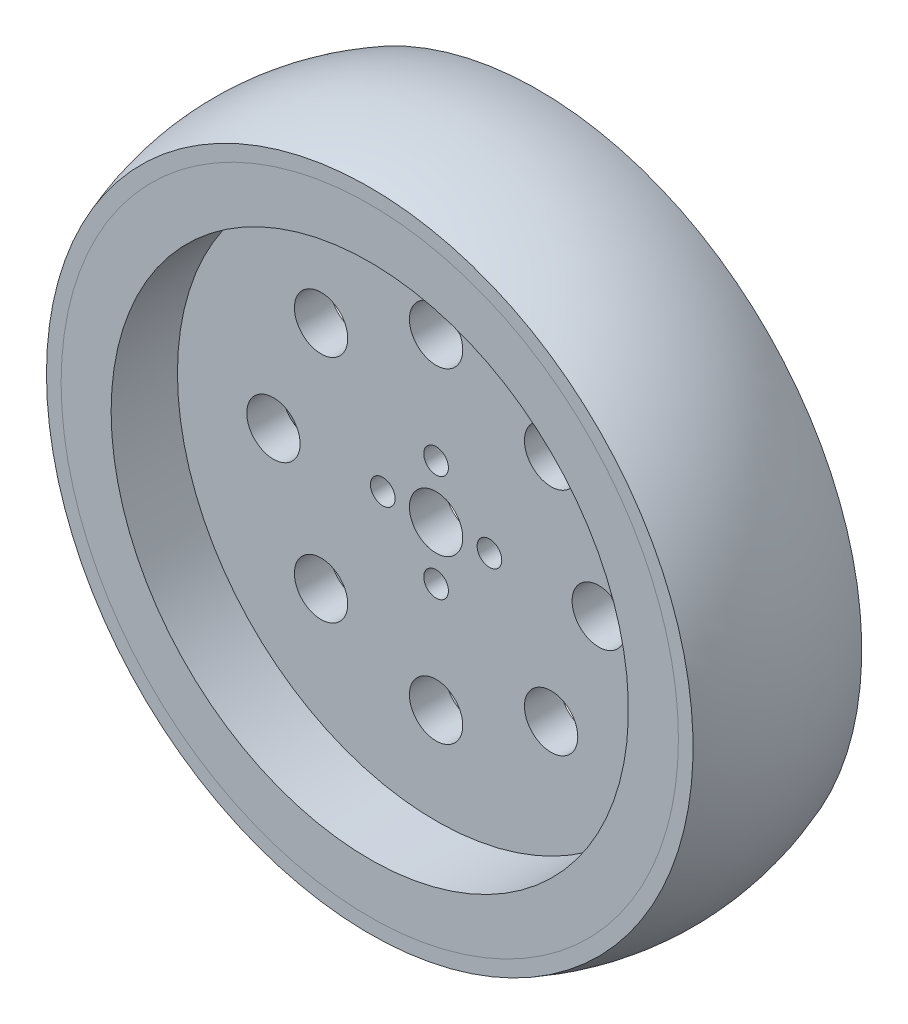
ISO-10303-21;
HEADER;
FILE_DESCRIPTION(('STEP AP214'),'2;1');
FILE_NAME('part.step','',(''),(''),'','','');
FILE_SCHEMA(('AUTOMOTIVE_DESIGN { 1 0 10303 214 1 1 1 1 }'));
ENDSEC;
DATA;
#1=APPLICATION_CONTEXT('core data for automotive mechanical design processes');
#2=APPLICATION_PROTOCOL_DEFINITION('international standard','automotive_design',2000,#1);
#3=PRODUCT_CONTEXT('',#1,'mechanical');
#4=PRODUCT('Part','Part','',(#3));
#5=PRODUCT_RELATED_PRODUCT_CATEGORY('part','',(#4));
#6=PRODUCT_DEFINITION_FORMATION('','',#4);
#7=PRODUCT_DEFINITION_CONTEXT('part definition',#1,'design');
#8=PRODUCT_DEFINITION('design','',#6,#7);
#9=PRODUCT_DEFINITION_SHAPE('','',#8);
#10=(LENGTH_UNIT() NAMED_UNIT(*) SI_UNIT(.MILLI.,.METRE.));
#11=(NAMED_UNIT(*) PLANE_ANGLE_UNIT() SI_UNIT($,.RADIAN.));
#12=(NAMED_UNIT(*) SI_UNIT($,.STERADIAN.) SOLID_ANGLE_UNIT());
#13=UNCERTAINTY_MEASURE_WITH_UNIT(LENGTH_MEASURE(1.E-05),#10,'distance_accuracy_value','');
#14=(GEOMETRIC_REPRESENTATION_CONTEXT(3) GLOBAL_UNCERTAINTY_ASSIGNED_CONTEXT((#13)) GLOBAL_UNIT_ASSIGNED_CONTEXT((#10,
#11,#12)) REPRESENTATION_CONTEXT('',''));
#15=CARTESIAN_POINT('',(0.,0.,0.));
#16=DIRECTION('',(0.,0.,1.));
#17=DIRECTION('',(1.,0.,0.));
#18=AXIS2_PLACEMENT_3D('',#15,#16,#17);
#19=CARTESIAN_POINT('',(38.8,0.,12.65));
#20=DIRECTION('',(0.,0.,-1.));
#21=DIRECTION('',(-1.,0.,0.));
#22=AXIS2_PLACEMENT_3D('',#19,#20,#21);
#23=PLANE('',#22);
#24=CARTESIAN_POINT('',(0.,0.,12.65));
#25=DIRECTION('',(0.,0.,-1.));
#26=DIRECTION('',(-1.,0.,0.));
#27=AXIS2_PLACEMENT_3D('',#24,#25,#26);
#28=CIRCLE('',#27,38.8);
#29=CARTESIAN_POINT('',(-38.8,0.,12.65));
#30=VERTEX_POINT('',#29);
#31=EDGE_CURVE('P0_E164',#30,#30,#28,.T.);
#32=ORIENTED_EDGE('',*,*,#31,.T.);
#33=EDGE_LOOP('',(#32));
#34=FACE_BOUND('',#33,.T.);
#35=CARTESIAN_POINT('',(0.,0.,12.65));
#36=DIRECTION('',(0.,0.,-1.));
#37=DIRECTION('',(-1.,0.,0.));
#38=AXIS2_PLACEMENT_3D('',#35,#36,#37);
#39=CIRCLE('',#38,46.3);
#40=CARTESIAN_POINT('',(-46.3,0.,12.65));
#41=VERTEX_POINT('',#40);
#42=EDGE_CURVE('P0_E10',#41,#41,#39,.T.);
#43=ORIENTED_EDGE('',*,*,#42,.F.);
#44=EDGE_LOOP('',(#43));
#45=FACE_BOUND('',#44,.T.);
#46=ADVANCED_FACE('P0_F14',(#34,#45),#23,.F.);
#47=CARTESIAN_POINT('',(0.,0.,-12.65));
#48=DIRECTION('',(0.,0.,-1.));
#49=DIRECTION('',(-1.,0.,0.));
#50=AXIS2_PLACEMENT_3D('',#47,#48,#49);
#51=CYLINDRICAL_SURFACE('',#50,46.3);
#52=CARTESIAN_POINT('',(0.,0.,10.65));
#53=DIRECTION('',(0.,0.,-1.));
#54=DIRECTION('',(-1.,0.,0.));
#55=AXIS2_PLACEMENT_3D('',#52,#53,#54);
#56=CIRCLE('',#55,46.3);
#57=CARTESIAN_POINT('',(-46.3,0.,10.65));
#58=VERTEX_POINT('',#57);
#59=EDGE_CURVE('P0_E21',#58,#58,#56,.T.);
#60=ORIENTED_EDGE('',*,*,#59,.F.);
#61=EDGE_LOOP('',(#60));
#62=FACE_BOUND('',#61,.T.);
#63=ORIENTED_EDGE('',*,*,#42,.T.);
#64=EDGE_LOOP('',(#63));
#65=FACE_BOUND('',#64,.T.);
#66=ADVANCED_FACE('P0_F236',(#62,#65),#51,.T.);
#67=CARTESIAN_POINT('',(46.3,0.,10.65));
#68=DIRECTION('',(0.,0.,1.));
#69=DIRECTION('',(1.,0.,0.));
#70=AXIS2_PLACEMENT_3D('',#67,#68,#69);
#71=PLANE('',#70);
#72=CARTESIAN_POINT('',(0.,0.,10.65));
#73=DIRECTION('',(0.,0.,-1.));
#74=DIRECTION('',(-1.,0.,0.));
#75=AXIS2_PLACEMENT_3D('',#72,#73,#74);
#76=CIRCLE('',#75,44.);
#77=CARTESIAN_POINT('',(-44.,0.,10.65));
#78=VERTEX_POINT('',#77);
#79=EDGE_CURVE('P0_E28',#78,#78,#76,.T.);
#80=ORIENTED_EDGE('',*,*,#79,.F.);
#81=EDGE_LOOP('',(#80));
#82=FACE_BOUND('',#81,.T.);
#83=ORIENTED_EDGE('',*,*,#59,.T.);
#84=EDGE_LOOP('',(#83));
#85=FACE_BOUND('',#84,.T.);
#86=ADVANCED_FACE('P0_F231',(#82,#85),#71,.F.);
#87=CARTESIAN_POINT('',(0.,0.,-12.65));
#88=DIRECTION('',(0.,0.,-1.));
#89=DIRECTION('',(-1.,0.,0.));
#90=AXIS2_PLACEMENT_3D('',#87,#88,#89);
#91=CYLINDRICAL_SURFACE('',#90,44.);
#92=CARTESIAN_POINT('',(0.,0.,-10.65));
#93=DIRECTION('',(0.,0.,-1.));
#94=DIRECTION('',(-1.,0.,0.));
#95=AXIS2_PLACEMENT_3D('',#92,#93,#94);
#96=CIRCLE('',#95,44.);
#97=CARTESIAN_POINT('',(-44.,0.,-10.65));
#98=VERTEX_POINT('',#97);
#99=EDGE_CURVE('P0_E34',#98,#98,#96,.T.);
#100=ORIENTED_EDGE('',*,*,#99,.F.);
#101=EDGE_LOOP('',(#100));
#102=FACE_BOUND('',#101,.T.);
#103=ORIENTED_EDGE('',*,*,#79,.T.);
#104=EDGE_LOOP('',(#103));
#105=FACE_BOUND('',#104,.T.);
#106=ADVANCED_FACE('P0_F225',(#102,#105),#91,.T.);
#107=CARTESIAN_POINT('',(44.,0.,-10.65));
#108=DIRECTION('',(0.,0.,-1.));
#109=DIRECTION('',(-1.,0.,0.));
#110=AXIS2_PLACEMENT_3D('',#107,#108,#109);
#111=PLANE('',#110);
#112=CARTESIAN_POINT('',(0.,0.,-10.65));
#113=DIRECTION('',(0.,0.,-1.));
#114=DIRECTION('',(-1.,0.,0.));
#115=AXIS2_PLACEMENT_3D('',#112,#113,#114);
#116=CIRCLE('',#115,46.3);
#117=CARTESIAN_POINT('',(-46.3,0.,-10.65));
#118=VERTEX_POINT('',#117);
#119=EDGE_CURVE('P0_E40',#118,#118,#116,.T.);
#120=ORIENTED_EDGE('',*,*,#119,.F.);
#121=EDGE_LOOP('',(#120));
#122=FACE_BOUND('',#121,.T.);
#123=ORIENTED_EDGE('',*,*,#99,.T.);
#124=EDGE_LOOP('',(#123));
#125=FACE_BOUND('',#124,.T.);
#126=ADVANCED_FACE('P0_F219',(#122,#125),#111,.F.);
#127=CARTESIAN_POINT('',(0.,0.,-12.65));
#128=DIRECTION('',(0.,0.,-1.));
#129=DIRECTION('',(-1.,0.,0.));
#130=AXIS2_PLACEMENT_3D('',#127,#128,#129);
#131=CYLINDRICAL_SURFACE('',#130,46.3);
#132=CARTESIAN_POINT('',(0.,0.,-12.65));
#133=DIRECTION('',(0.,0.,-1.));
#134=DIRECTION('',(-1.,0.,0.));
#135=AXIS2_PLACEMENT_3D('',#132,#133,#134);
#136=CIRCLE('',#135,46.3);
#137=CARTESIAN_POINT('',(-46.3,0.,-12.65));
#138=VERTEX_POINT('',#137);
#139=EDGE_CURVE('P0_E44',#138,#138,#136,.T.);
#140=ORIENTED_EDGE('',*,*,#139,.F.);
#141=EDGE_LOOP('',(#140));
#142=FACE_BOUND('',#141,.T.);
#143=ORIENTED_EDGE('',*,*,#119,.T.);
#144=EDGE_LOOP('',(#143));
#145=FACE_BOUND('',#144,.T.);
#146=ADVANCED_FACE('P0_F213',(#142,#145),#131,.T.);
#147=CARTESIAN_POINT('',(46.3,0.,-12.65));
#148=DIRECTION('',(0.,0.,1.));
#149=DIRECTION('',(1.,0.,0.));
#150=AXIS2_PLACEMENT_3D('',#147,#148,#149);
#151=PLANE('',#150);
#152=CARTESIAN_POINT('',(0.,0.,-12.65));
#153=DIRECTION('',(0.,0.,-1.));
#154=DIRECTION('',(-1.,0.,0.));
#155=AXIS2_PLACEMENT_3D('',#152,#153,#154);
#156=CIRCLE('',#155,38.8);
#157=CARTESIAN_POINT('',(-38.8,0.,-12.65));
#158=VERTEX_POINT('',#157);
#159=EDGE_CURVE('P0_E160',#158,#158,#156,.T.);
#160=ORIENTED_EDGE('',*,*,#159,.F.);
#161=EDGE_LOOP('',(#160));
#162=FACE_BOUND('',#161,.T.);
#163=ORIENTED_EDGE('',*,*,#139,.T.);
#164=EDGE_LOOP('',(#163));
#165=FACE_BOUND('',#164,.T.);
#166=ADVANCED_FACE('P0_F207',(#162,#165),#151,.F.);
#167=CARTESIAN_POINT('',(0.,0.,-12.65));
#168=DIRECTION('',(0.,0.,-1.));
#169=DIRECTION('',(-1.,0.,0.));
#170=AXIS2_PLACEMENT_3D('',#167,#168,#169);
#171=CYLINDRICAL_SURFACE('',#170,38.8);
#172=CARTESIAN_POINT('',(0.,0.,-2.69999999999999));
#173=DIRECTION('',(0.,0.,-1.));
#174=DIRECTION('',(-1.,0.,0.));
#175=AXIS2_PLACEMENT_3D('',#172,#173,#174);
#176=CIRCLE('',#175,38.8);
#177=CARTESIAN_POINT('',(-38.8,0.,-2.69999999999998));
#178=VERTEX_POINT('',#177);
#179=EDGE_CURVE('P0_E48',#178,#178,#176,.T.);
#180=ORIENTED_EDGE('',*,*,#179,.F.);
#181=EDGE_LOOP('',(#180));
#182=FACE_BOUND('',#181,.T.);
#183=ORIENTED_EDGE('',*,*,#159,.T.);
#184=EDGE_LOOP('',(#183));
#185=FACE_BOUND('',#184,.T.);
#186=ADVANCED_FACE('P0_F193',(#182,#185),#171,.F.);
#187=CARTESIAN_POINT('',(0.,0.,-12.65));
#188=DIRECTION('',(0.,0.,-1.));
#189=DIRECTION('',(-1.,0.,0.));
#190=AXIS2_PLACEMENT_3D('',#187,#188,#189);
#191=CYLINDRICAL_SURFACE('',#190,4.);
#192=CARTESIAN_POINT('',(0.,0.,2.7));
#193=DIRECTION('',(0.,0.,-1.));
#194=DIRECTION('',(-1.,0.,0.));
#195=AXIS2_PLACEMENT_3D('',#192,#193,#194);
#196=CIRCLE('',#195,4.);
#197=CARTESIAN_POINT('',(-4.,0.,2.7));
#198=VERTEX_POINT('',#197);
#199=EDGE_CURVE('P0_E104',#198,#198,#196,.T.);
#200=ORIENTED_EDGE('',*,*,#199,.F.);
#201=EDGE_LOOP('',(#200));
#202=FACE_BOUND('',#201,.T.);
#203=CARTESIAN_POINT('',(0.,0.,-2.69999999999999));
#204=DIRECTION('',(0.,0.,-1.));
#205=DIRECTION('',(-1.,0.,0.));
#206=AXIS2_PLACEMENT_3D('',#203,#204,#205);
#207=CIRCLE('',#206,4.);
#208=CARTESIAN_POINT('',(-4.,0.,-2.69999999999999));
#209=VERTEX_POINT('',#208);
#210=EDGE_CURVE('P0_E52',#209,#209,#207,.T.);
#211=ORIENTED_EDGE('',*,*,#210,.T.);
#212=EDGE_LOOP('',(#211));
#213=FACE_BOUND('',#212,.T.);
#214=ADVANCED_FACE('P0_F189',(#202,#213),#191,.F.);
#215=CARTESIAN_POINT('',(-17.2534054609517,17.2534054609518,-12.65));
#216=DIRECTION('',(0.,0.,1.));
#217=DIRECTION('',(1.,0.,0.));
#218=AXIS2_PLACEMENT_3D('',#215,#216,#217);
#219=CYLINDRICAL_SURFACE('',#218,4.);
#220=CARTESIAN_POINT('',(-17.2534054609517,17.2534054609518,2.70000000000001));
#221=DIRECTION('',(0.,0.,-1.));
#222=DIRECTION('',(-1.,0.,0.));
#223=AXIS2_PLACEMENT_3D('',#220,#221,#222);
#224=CIRCLE('',#223,4.);
#225=CARTESIAN_POINT('',(-21.2534054609517,17.2534054609518,2.70000000000001));
#226=VERTEX_POINT('',#225);
#227=EDGE_CURVE('P0_E108',#226,#226,#224,.T.);
#228=ORIENTED_EDGE('',*,*,#227,.F.);
#229=EDGE_LOOP('',(#228));
#230=FACE_BOUND('',#229,.T.);
#231=CARTESIAN_POINT('',(-17.2534054609517,17.2534054609518,-2.69999999999999));
#232=DIRECTION('',(0.,0.,1.));
#233=DIRECTION('',(1.,0.,0.));
#234=AXIS2_PLACEMENT_3D('',#231,#232,#233);
#235=CIRCLE('',#234,4.);
#236=CARTESIAN_POINT('',(-13.2534054609517,17.2534054609518,-2.69999999999999));
#237=VERTEX_POINT('',#236);
#238=EDGE_CURVE('P0_E56',#237,#237,#235,.T.);
#239=ORIENTED_EDGE('',*,*,#238,.F.);
#240=EDGE_LOOP('',(#239));
#241=FACE_BOUND('',#240,.T.);
#242=ADVANCED_FACE('P0_F192',(#230,#241),#219,.F.);
#243=CARTESIAN_POINT('',(-24.4,0.,-12.65));
#244=DIRECTION('',(0.,0.,1.));
#245=DIRECTION('',(1.,0.,0.));
#246=AXIS2_PLACEMENT_3D('',#243,#244,#245);
#247=CYLINDRICAL_SURFACE('',#246,4.);
#248=CARTESIAN_POINT('',(-24.4,0.,2.70000000000001));
#249=DIRECTION('',(0.,0.,-1.));
#250=DIRECTION('',(-1.,0.,0.));
#251=AXIS2_PLACEMENT_3D('',#248,#249,#250);
#252=CIRCLE('',#251,4.);
#253=CARTESIAN_POINT('',(-28.4,0.,2.70000000000001));
#254=VERTEX_POINT('',#253);
#255=EDGE_CURVE('P0_E112',#254,#254,#252,.T.);
#256=ORIENTED_EDGE('',*,*,#255,.F.);
#257=EDGE_LOOP('',(#256));
#258=FACE_BOUND('',#257,.T.);
#259=CARTESIAN_POINT('',(-24.4,0.,-2.69999999999998));
#260=DIRECTION('',(0.,0.,1.));
#261=DIRECTION('',(1.,0.,0.));
#262=AXIS2_PLACEMENT_3D('',#259,#260,#261);
#263=CIRCLE('',#262,4.);
#264=CARTESIAN_POINT('',(-20.4,0.,-2.69999999999999));
#265=VERTEX_POINT('',#264);
#266=EDGE_CURVE('P0_E60',#265,#265,#263,.T.);
#267=ORIENTED_EDGE('',*,*,#266,.F.);
#268=EDGE_LOOP('',(#267));
#269=FACE_BOUND('',#268,.T.);
#270=ADVANCED_FACE('P0_F319',(#258,#269),#247,.F.);
#271=CARTESIAN_POINT('',(-17.2534054609518,-17.2534054609517,-12.65));
#272=DIRECTION('',(0.,0.,1.));
#273=DIRECTION('',(1.,0.,0.));
#274=AXIS2_PLACEMENT_3D('',#271,#272,#273);
#275=CYLINDRICAL_SURFACE('',#274,4.);
#276=CARTESIAN_POINT('',(-17.2534054609518,-17.2534054609517,2.70000000000001));
#277=DIRECTION('',(0.,0.,-1.));
#278=DIRECTION('',(-1.,0.,0.));
#279=AXIS2_PLACEMENT_3D('',#276,#277,#278);
#280=CIRCLE('',#279,4.);
#281=CARTESIAN_POINT('',(-21.2534054609518,-17.2534054609517,2.70000000000001));
#282=VERTEX_POINT('',#281);
#283=EDGE_CURVE('P0_E116',#282,#282,#280,.T.);
#284=ORIENTED_EDGE('',*,*,#283,.F.);
#285=EDGE_LOOP('',(#284));
#286=FACE_BOUND('',#285,.T.);
#287=CARTESIAN_POINT('',(-17.2534054609518,-17.2534054609517,-2.69999999999999));
#288=DIRECTION('',(0.,0.,1.));
#289=DIRECTION('',(1.,0.,0.));
#290=AXIS2_PLACEMENT_3D('',#287,#288,#289);
#291=CIRCLE('',#290,4.);
#292=CARTESIAN_POINT('',(-13.2534054609518,-17.2534054609517,-2.69999999999999));
#293=VERTEX_POINT('',#292);
#294=EDGE_CURVE('P0_E64',#293,#293,#291,.T.);
#295=ORIENTED_EDGE('',*,*,#294,.F.);
#296=EDGE_LOOP('',(#295));
#297=FACE_BOUND('',#296,.T.);
#298=ADVANCED_FACE('P0_F331',(#286,#297),#275,.F.);
#299=CARTESIAN_POINT('',(0.,-24.4,-12.65));
#300=DIRECTION('',(0.,0.,1.));
#301=DIRECTION('',(1.,0.,0.));
#302=AXIS2_PLACEMENT_3D('',#299,#300,#301);
#303=CYLINDRICAL_SURFACE('',#302,4.);
#304=CARTESIAN_POINT('',(0.,-24.4,2.7));
#305=DIRECTION('',(0.,0.,-1.));
#306=DIRECTION('',(-1.,0.,0.));
#307=AXIS2_PLACEMENT_3D('',#304,#305,#306);
#308=CIRCLE('',#307,4.);
#309=CARTESIAN_POINT('',(-4.,-24.4,2.70000000000001));
#310=VERTEX_POINT('',#309);
#311=EDGE_CURVE('P0_E120',#310,#310,#308,.T.);
#312=ORIENTED_EDGE('',*,*,#311,.F.);
#313=EDGE_LOOP('',(#312));
#314=FACE_BOUND('',#313,.T.);
#315=CARTESIAN_POINT('',(0.,-24.4,-2.69999999999999));
#316=DIRECTION('',(0.,0.,1.));
#317=DIRECTION('',(1.,0.,0.));
#318=AXIS2_PLACEMENT_3D('',#315,#316,#317);
#319=CIRCLE('',#318,4.);
#320=CARTESIAN_POINT('',(4.,-24.4,-2.69999999999999));
#321=VERTEX_POINT('',#320);
#322=EDGE_CURVE('P0_E68',#321,#321,#319,.T.);
#323=ORIENTED_EDGE('',*,*,#322,.F.);
#324=EDGE_LOOP('',(#323));
#325=FACE_BOUND('',#324,.T.);
#326=ADVANCED_FACE('P0_F343',(#314,#325),#303,.F.);
#327=CARTESIAN_POINT('',(17.2534054609517,-17.2534054609518,-12.65));
#328=DIRECTION('',(0.,0.,1.));
#329=DIRECTION('',(1.,0.,0.));
#330=AXIS2_PLACEMENT_3D('',#327,#328,#329);
#331=CYLINDRICAL_SURFACE('',#330,4.);
#332=CARTESIAN_POINT('',(17.2534054609517,-17.2534054609518,2.7));
#333=DIRECTION('',(0.,0.,-1.));
#334=DIRECTION('',(-1.,0.,0.));
#335=AXIS2_PLACEMENT_3D('',#332,#333,#334);
#336=CIRCLE('',#335,4.);
#337=CARTESIAN_POINT('',(13.2534054609517,-17.2534054609518,2.7));
#338=VERTEX_POINT('',#337);
#339=EDGE_CURVE('P0_E124',#338,#338,#336,.T.);
#340=ORIENTED_EDGE('',*,*,#339,.F.);
#341=EDGE_LOOP('',(#340));
#342=FACE_BOUND('',#341,.T.);
#343=CARTESIAN_POINT('',(17.2534054609517,-17.2534054609518,-2.7));
#344=DIRECTION('',(0.,0.,1.));
#345=DIRECTION('',(1.,0.,0.));
#346=AXIS2_PLACEMENT_3D('',#343,#344,#345);
#347=CIRCLE('',#346,4.);
#348=CARTESIAN_POINT('',(21.2534054609517,-17.2534054609518,-2.7));
#349=VERTEX_POINT('',#348);
#350=EDGE_CURVE('P0_E72',#349,#349,#347,.T.);
#351=ORIENTED_EDGE('',*,*,#350,.F.);
#352=EDGE_LOOP('',(#351));
#353=FACE_BOUND('',#352,.T.);
#354=ADVANCED_FACE('P0_F355',(#342,#353),#331,.F.);
#355=CARTESIAN_POINT('',(24.4,0.,-12.65));
#356=DIRECTION('',(0.,0.,1.));
#357=DIRECTION('',(1.,0.,0.));
#358=AXIS2_PLACEMENT_3D('',#355,#356,#357);
#359=CYLINDRICAL_SURFACE('',#358,3.99999999999999);
#360=CARTESIAN_POINT('',(24.4,0.,2.7));
#361=DIRECTION('',(0.,0.,-1.));
#362=DIRECTION('',(-1.,0.,0.));
#363=AXIS2_PLACEMENT_3D('',#360,#361,#362);
#364=CIRCLE('',#363,3.99999999999999);
#365=CARTESIAN_POINT('',(20.4,0.,2.7));
#366=VERTEX_POINT('',#365);
#367=EDGE_CURVE('P0_E128',#366,#366,#364,.T.);
#368=ORIENTED_EDGE('',*,*,#367,.F.);
#369=EDGE_LOOP('',(#368));
#370=FACE_BOUND('',#369,.T.);
#371=CARTESIAN_POINT('',(24.4,0.,-2.7));
#372=DIRECTION('',(0.,0.,1.));
#373=DIRECTION('',(1.,0.,0.));
#374=AXIS2_PLACEMENT_3D('',#371,#372,#373);
#375=CIRCLE('',#374,3.99999999999999);
#376=CARTESIAN_POINT('',(28.4,0.,-2.7));
#377=VERTEX_POINT('',#376);
#378=EDGE_CURVE('P0_E76',#377,#377,#375,.T.);
#379=ORIENTED_EDGE('',*,*,#378,.F.);
#380=EDGE_LOOP('',(#379));
#381=FACE_BOUND('',#380,.T.);
#382=ADVANCED_FACE('P0_F367',(#370,#381),#359,.F.);
#383=CARTESIAN_POINT('',(17.2534054609518,17.2534054609517,-12.65));
#384=DIRECTION('',(0.,0.,1.));
#385=DIRECTION('',(1.,0.,0.));
#386=AXIS2_PLACEMENT_3D('',#383,#384,#385);
#387=CYLINDRICAL_SURFACE('',#386,4.);
#388=CARTESIAN_POINT('',(17.2534054609518,17.2534054609517,2.7));
#389=DIRECTION('',(0.,0.,-1.));
#390=DIRECTION('',(-1.,0.,0.));
#391=AXIS2_PLACEMENT_3D('',#388,#389,#390);
#392=CIRCLE('',#391,4.);
#393=CARTESIAN_POINT('',(13.2534054609518,17.2534054609517,2.7));
#394=VERTEX_POINT('',#393);
#395=EDGE_CURVE('P0_E132',#394,#394,#392,.T.);
#396=ORIENTED_EDGE('',*,*,#395,.F.);
#397=EDGE_LOOP('',(#396));
#398=FACE_BOUND('',#397,.T.);
#399=CARTESIAN_POINT('',(17.2534054609518,17.2534054609517,-2.7));
#400=DIRECTION('',(0.,0.,1.));
#401=DIRECTION('',(1.,0.,0.));
#402=AXIS2_PLACEMENT_3D('',#399,#400,#401);
#403=CIRCLE('',#402,4.);
#404=CARTESIAN_POINT('',(21.2534054609518,17.2534054609517,-2.7));
#405=VERTEX_POINT('',#404);
#406=EDGE_CURVE('P0_E80',#405,#405,#403,.T.);
#407=ORIENTED_EDGE('',*,*,#406,.F.);
#408=EDGE_LOOP('',(#407));
#409=FACE_BOUND('',#408,.T.);
#410=ADVANCED_FACE('P0_F379',(#398,#409),#387,.F.);
#411=CARTESIAN_POINT('',(0.,24.4,-12.65));
#412=DIRECTION('',(0.,0.,1.));
#413=DIRECTION('',(1.,0.,0.));
#414=AXIS2_PLACEMENT_3D('',#411,#412,#413);
#415=CYLINDRICAL_SURFACE('',#414,4.);
#416=CARTESIAN_POINT('',(0.,24.4,2.7));
#417=DIRECTION('',(0.,0.,-1.));
#418=DIRECTION('',(-1.,0.,0.));
#419=AXIS2_PLACEMENT_3D('',#416,#417,#418);
#420=CIRCLE('',#419,4.);
#421=CARTESIAN_POINT('',(-4.,24.4,2.70000000000001));
#422=VERTEX_POINT('',#421);
#423=EDGE_CURVE('P0_E136',#422,#422,#420,.T.);
#424=ORIENTED_EDGE('',*,*,#423,.F.);
#425=EDGE_LOOP('',(#424));
#426=FACE_BOUND('',#425,.T.);
#427=CARTESIAN_POINT('',(0.,24.4,-2.69999999999999));
#428=DIRECTION('',(0.,0.,1.));
#429=DIRECTION('',(1.,0.,0.));
#430=AXIS2_PLACEMENT_3D('',#427,#428,#429);
#431=CIRCLE('',#430,4.);
#432=CARTESIAN_POINT('',(4.,24.4,-2.69999999999999));
#433=VERTEX_POINT('',#432);
#434=EDGE_CURVE('P0_E84',#433,#433,#431,.T.);
#435=ORIENTED_EDGE('',*,*,#434,.F.);
#436=EDGE_LOOP('',(#435));
#437=FACE_BOUND('',#436,.T.);
#438=ADVANCED_FACE('P0_F391',(#426,#437),#415,.F.);
#439=CARTESIAN_POINT('',(-8.,0.,-12.65));
#440=DIRECTION('',(0.,0.,1.));
#441=DIRECTION('',(1.,0.,0.));
#442=AXIS2_PLACEMENT_3D('',#439,#440,#441);
#443=CYLINDRICAL_SURFACE('',#442,1.85);
#444=CARTESIAN_POINT('',(-8.,0.,2.70000000000001));
#445=DIRECTION('',(0.,0.,-1.));
#446=DIRECTION('',(-1.,0.,0.));
#447=AXIS2_PLACEMENT_3D('',#444,#445,#446);
#448=CIRCLE('',#447,1.85);
#449=CARTESIAN_POINT('',(-9.85,0.,2.70000000000001));
#450=VERTEX_POINT('',#449);
#451=EDGE_CURVE('P0_E140',#450,#450,#448,.T.);
#452=ORIENTED_EDGE('',*,*,#451,.F.);
#453=EDGE_LOOP('',(#452));
#454=FACE_BOUND('',#453,.T.);
#455=CARTESIAN_POINT('',(-8.,0.,-2.69999999999999));
#456=DIRECTION('',(0.,0.,1.));
#457=DIRECTION('',(1.,0.,0.));
#458=AXIS2_PLACEMENT_3D('',#455,#456,#457);
#459=CIRCLE('',#458,1.85);
#460=CARTESIAN_POINT('',(-6.15,0.,-2.69999999999999));
#461=VERTEX_POINT('',#460);
#462=EDGE_CURVE('P0_E88',#461,#461,#459,.T.);
#463=ORIENTED_EDGE('',*,*,#462,.F.);
#464=EDGE_LOOP('',(#463));
#465=FACE_BOUND('',#464,.T.);
#466=ADVANCED_FACE('P0_F403',(#454,#465),#443,.F.);
#467=CARTESIAN_POINT('',(0.,-8.,-12.65));
#468=DIRECTION('',(0.,0.,1.));
#469=DIRECTION('',(1.,0.,0.));
#470=AXIS2_PLACEMENT_3D('',#467,#468,#469);
#471=CYLINDRICAL_SURFACE('',#470,1.85);
#472=CARTESIAN_POINT('',(0.,-8.,2.7));
#473=DIRECTION('',(0.,0.,-1.));
#474=DIRECTION('',(-1.,0.,0.));
#475=AXIS2_PLACEMENT_3D('',#472,#473,#474);
#476=CIRCLE('',#475,1.85);
#477=CARTESIAN_POINT('',(-1.85,-8.,2.70000000000001));
#478=VERTEX_POINT('',#477);
#479=EDGE_CURVE('P0_E144',#478,#478,#476,.T.);
#480=ORIENTED_EDGE('',*,*,#479,.F.);
#481=EDGE_LOOP('',(#480));
#482=FACE_BOUND('',#481,.T.);
#483=CARTESIAN_POINT('',(0.,-8.,-2.69999999999999));
#484=DIRECTION('',(0.,0.,1.));
#485=DIRECTION('',(1.,0.,0.));
#486=AXIS2_PLACEMENT_3D('',#483,#484,#485);
#487=CIRCLE('',#486,1.85);
#488=CARTESIAN_POINT('',(1.85,-8.,-2.69999999999999));
#489=VERTEX_POINT('',#488);
#490=EDGE_CURVE('P0_E92',#489,#489,#487,.T.);
#491=ORIENTED_EDGE('',*,*,#490,.F.);
#492=EDGE_LOOP('',(#491));
#493=FACE_BOUND('',#492,.T.);
#494=ADVANCED_FACE('P0_F415',(#482,#493),#471,.F.);
#495=CARTESIAN_POINT('',(8.,0.,-12.65));
#496=DIRECTION('',(0.,0.,1.));
#497=DIRECTION('',(1.,0.,0.));
#498=AXIS2_PLACEMENT_3D('',#495,#496,#497);
#499=CYLINDRICAL_SURFACE('',#498,1.85);
#500=CARTESIAN_POINT('',(8.,0.,2.7));
#501=DIRECTION('',(0.,0.,-1.));
#502=DIRECTION('',(-1.,0.,0.));
#503=AXIS2_PLACEMENT_3D('',#500,#501,#502);
#504=CIRCLE('',#503,1.85);
#505=CARTESIAN_POINT('',(6.15,0.,2.7));
#506=VERTEX_POINT('',#505);
#507=EDGE_CURVE('P0_E148',#506,#506,#504,.T.);
#508=ORIENTED_EDGE('',*,*,#507,.F.);
#509=EDGE_LOOP('',(#508));
#510=FACE_BOUND('',#509,.T.);
#511=CARTESIAN_POINT('',(8.,0.,-2.69999999999999));
#512=DIRECTION('',(0.,0.,1.));
#513=DIRECTION('',(1.,0.,0.));
#514=AXIS2_PLACEMENT_3D('',#511,#512,#513);
#515=CIRCLE('',#514,1.85);
#516=CARTESIAN_POINT('',(9.85,0.,-2.69999999999999));
#517=VERTEX_POINT('',#516);
#518=EDGE_CURVE('P0_E96',#517,#517,#515,.T.);
#519=ORIENTED_EDGE('',*,*,#518,.F.);
#520=EDGE_LOOP('',(#519));
#521=FACE_BOUND('',#520,.T.);
#522=ADVANCED_FACE('P0_F200',(#510,#521),#499,.F.);
#523=CARTESIAN_POINT('',(38.8,0.,-2.7));
#524=DIRECTION('',(0.,0.,1.));
#525=DIRECTION('',(1.,0.,0.));
#526=AXIS2_PLACEMENT_3D('',#523,#524,#525);
#527=PLANE('',#526);
#528=CARTESIAN_POINT('',(0.,8.,-2.69999999999999));
#529=DIRECTION('',(0.,0.,1.));
#530=DIRECTION('',(1.,0.,0.));
#531=AXIS2_PLACEMENT_3D('',#528,#529,#530);
#532=CIRCLE('',#531,1.85);
#533=CARTESIAN_POINT('',(1.85,8.,-2.69999999999999));
#534=VERTEX_POINT('',#533);
#535=EDGE_CURVE('P0_E100',#534,#534,#532,.T.);
#536=ORIENTED_EDGE('',*,*,#535,.T.);
#537=EDGE_LOOP('',(#536));
#538=FACE_BOUND('',#537,.T.);
#539=ORIENTED_EDGE('',*,*,#518,.T.);
#540=EDGE_LOOP('',(#539));
#541=FACE_BOUND('',#540,.T.);
#542=ORIENTED_EDGE('',*,*,#490,.T.);
#543=EDGE_LOOP('',(#542));
#544=FACE_BOUND('',#543,.T.);
#545=ORIENTED_EDGE('',*,*,#462,.T.);
#546=EDGE_LOOP('',(#545));
#547=FACE_BOUND('',#546,.T.);
#548=ORIENTED_EDGE('',*,*,#434,.T.);
#549=EDGE_LOOP('',(#548));
#550=FACE_BOUND('',#549,.T.);
#551=ORIENTED_EDGE('',*,*,#406,.T.);
#552=EDGE_LOOP('',(#551));
#553=FACE_BOUND('',#552,.T.);
#554=ORIENTED_EDGE('',*,*,#378,.T.);
#555=EDGE_LOOP('',(#554));
#556=FACE_BOUND('',#555,.T.);
#557=ORIENTED_EDGE('',*,*,#350,.T.);
#558=EDGE_LOOP('',(#557));
#559=FACE_BOUND('',#558,.T.);
#560=ORIENTED_EDGE('',*,*,#322,.T.);
#561=EDGE_LOOP('',(#560));
#562=FACE_BOUND('',#561,.T.);
#563=ORIENTED_EDGE('',*,*,#294,.T.);
#564=EDGE_LOOP('',(#563));
#565=FACE_BOUND('',#564,.T.);
#566=ORIENTED_EDGE('',*,*,#266,.T.);
#567=EDGE_LOOP('',(#566));
#568=FACE_BOUND('',#567,.T.);
#569=ORIENTED_EDGE('',*,*,#238,.T.);
#570=EDGE_LOOP('',(#569));
#571=FACE_BOUND('',#570,.T.);
#572=ORIENTED_EDGE('',*,*,#210,.F.);
#573=EDGE_LOOP('',(#572));
#574=FACE_BOUND('',#573,.T.);
#575=ORIENTED_EDGE('',*,*,#179,.T.);
#576=EDGE_LOOP('',(#575));
#577=FACE_BOUND('',#576,.T.);
#578=ADVANCED_FACE('P0_F197',(#538,#541,#544,#547,#550,#553,#556,#559,#562,#565,#568,#571,#574,
#577),#527,.F.);
#579=CARTESIAN_POINT('',(0.,8.,-12.65));
#580=DIRECTION('',(0.,0.,1.));
#581=DIRECTION('',(1.,0.,0.));
#582=AXIS2_PLACEMENT_3D('',#579,#580,#581);
#583=CYLINDRICAL_SURFACE('',#582,1.85);
#584=CARTESIAN_POINT('',(0.,8.,2.7));
#585=DIRECTION('',(0.,0.,-1.));
#586=DIRECTION('',(-1.,0.,0.));
#587=AXIS2_PLACEMENT_3D('',#584,#585,#586);
#588=CIRCLE('',#587,1.85);
#589=CARTESIAN_POINT('',(-1.85,8.,2.70000000000001));
#590=VERTEX_POINT('',#589);
#591=EDGE_CURVE('P0_E152',#590,#590,#588,.T.);
#592=ORIENTED_EDGE('',*,*,#591,.F.);
#593=EDGE_LOOP('',(#592));
#594=FACE_BOUND('',#593,.T.);
#595=ORIENTED_EDGE('',*,*,#535,.F.);
#596=EDGE_LOOP('',(#595));
#597=FACE_BOUND('',#596,.T.);
#598=ADVANCED_FACE('P0_F184',(#594,#597),#583,.F.);
#599=CARTESIAN_POINT('',(4.,0.,2.7));
#600=DIRECTION('',(0.,0.,-1.));
#601=DIRECTION('',(-1.,0.,0.));
#602=AXIS2_PLACEMENT_3D('',#599,#600,#601);
#603=PLANE('',#602);
#604=ORIENTED_EDGE('',*,*,#591,.T.);
#605=EDGE_LOOP('',(#604));
#606=FACE_BOUND('',#605,.T.);
#607=ORIENTED_EDGE('',*,*,#507,.T.);
#608=EDGE_LOOP('',(#607));
#609=FACE_BOUND('',#608,.T.);
#610=ORIENTED_EDGE('',*,*,#479,.T.);
#611=EDGE_LOOP('',(#610));
#612=FACE_BOUND('',#611,.T.);
#613=ORIENTED_EDGE('',*,*,#451,.T.);
#614=EDGE_LOOP('',(#613));
#615=FACE_BOUND('',#614,.T.);
#616=ORIENTED_EDGE('',*,*,#423,.T.);
#617=EDGE_LOOP('',(#616));
#618=FACE_BOUND('',#617,.T.);
#619=ORIENTED_EDGE('',*,*,#395,.T.);
#620=EDGE_LOOP('',(#619));
#621=FACE_BOUND('',#620,.T.);
#622=ORIENTED_EDGE('',*,*,#367,.T.);
#623=EDGE_LOOP('',(#622));
#624=FACE_BOUND('',#623,.T.);
#625=ORIENTED_EDGE('',*,*,#339,.T.);
#626=EDGE_LOOP('',(#625));
#627=FACE_BOUND('',#626,.T.);
#628=ORIENTED_EDGE('',*,*,#311,.T.);
#629=EDGE_LOOP('',(#628));
#630=FACE_BOUND('',#629,.T.);
#631=ORIENTED_EDGE('',*,*,#283,.T.);
#632=EDGE_LOOP('',(#631));
#633=FACE_BOUND('',#632,.T.);
#634=ORIENTED_EDGE('',*,*,#255,.T.);
#635=EDGE_LOOP('',(#634));
#636=FACE_BOUND('',#635,.T.);
#637=ORIENTED_EDGE('',*,*,#227,.T.);
#638=EDGE_LOOP('',(#637));
#639=FACE_BOUND('',#638,.T.);
#640=CARTESIAN_POINT('',(0.,0.,2.70000000000001));
#641=DIRECTION('',(0.,0.,-1.));
#642=DIRECTION('',(-1.,0.,0.));
#643=AXIS2_PLACEMENT_3D('',#640,#641,#642);
#644=CIRCLE('',#643,38.8);
#645=CARTESIAN_POINT('',(-38.8,0.,2.70000000000002));
#646=VERTEX_POINT('',#645);
#647=EDGE_CURVE('P0_E156',#646,#646,#644,.T.);
#648=ORIENTED_EDGE('',*,*,#647,.F.);
#649=EDGE_LOOP('',(#648));
#650=FACE_BOUND('',#649,.T.);
#651=ORIENTED_EDGE('',*,*,#199,.T.);
#652=EDGE_LOOP('',(#651));
#653=FACE_BOUND('',#652,.T.);
#654=ADVANCED_FACE('P0_F178',(#606,#609,#612,#615,#618,#621,#624,#627,#630,#633,#636,#639,#650,
#653),#603,.F.);
#655=CARTESIAN_POINT('',(0.,0.,-12.65));
#656=DIRECTION('',(0.,0.,-1.));
#657=DIRECTION('',(-1.,0.,0.));
#658=AXIS2_PLACEMENT_3D('',#655,#656,#657);
#659=CYLINDRICAL_SURFACE('',#658,38.8);
#660=ORIENTED_EDGE('',*,*,#31,.F.);
#661=EDGE_LOOP('',(#660));
#662=FACE_BOUND('',#661,.T.);
#663=ORIENTED_EDGE('',*,*,#647,.T.);
#664=EDGE_LOOP('',(#663));
#665=FACE_BOUND('',#664,.T.);
#666=ADVANCED_FACE('P0_F175',(#662,#665),#659,.F.);
#667=CLOSED_SHELL('',(#46,#66,#86,#106,#126,#146,#166,#186,#214,#242,#270,#298,#326,#354,#382,
#410,#438,#466,#494,#522,#578,#598,#654,#666));
#668=MANIFOLD_SOLID_BREP('P0_B1',#667);
#669=CARTESIAN_POINT('',(46.3,0.,-12.65));
#670=DIRECTION('',(0.,0.,1.));
#671=DIRECTION('',(1.,0.,0.));
#672=AXIS2_PLACEMENT_3D('',#669,#670,#671);
#673=PLANE('',#672);
#674=CARTESIAN_POINT('',(0.,0.,-12.65));
#675=DIRECTION('',(0.,0.,-1.));
#676=DIRECTION('',(-1.,0.,0.));
#677=AXIS2_PLACEMENT_3D('',#674,#675,#676);
#678=CIRCLE('',#677,46.3);
#679=CARTESIAN_POINT('',(-46.3,0.,-12.65));
#680=VERTEX_POINT('',#679);
#681=EDGE_CURVE('P1_E48',#680,#680,#678,.T.);
#682=ORIENTED_EDGE('',*,*,#681,.F.);
#683=EDGE_LOOP('',(#682));
#684=FACE_BOUND('',#683,.T.);
#685=CARTESIAN_POINT('',(0.,0.,-12.65));
#686=DIRECTION('',(0.,0.,-1.));
#687=DIRECTION('',(-1.,0.,0.));
#688=AXIS2_PLACEMENT_3D('',#685,#686,#687);
#689=CIRCLE('',#688,48.5);
#690=CARTESIAN_POINT('',(-48.5,0.,-12.65));
#691=VERTEX_POINT('',#690);
#692=EDGE_CURVE('P1_E9',#691,#691,#689,.T.);
#693=ORIENTED_EDGE('',*,*,#692,.T.);
#694=EDGE_LOOP('',(#693));
#695=FACE_BOUND('',#694,.T.);
#696=ADVANCED_FACE('P1_F13',(#684,#695),#673,.F.);
#697=CARTESIAN_POINT('',(0.,0.,0.));
#698=DIRECTION('',(0.,0.,-1.));
#699=DIRECTION('',(-1.,0.,0.));
#700=AXIS2_PLACEMENT_3D('',#697,#698,#699);
#701=DEGENERATE_TOROIDAL_SURFACE('',#700,14.8625,35.9375,.T.);
#702=ORIENTED_EDGE('',*,*,#692,.F.);
#703=EDGE_LOOP('',(#702));
#704=FACE_BOUND('',#703,.T.);
#705=CARTESIAN_POINT('',(0.,0.,12.65));
#706=DIRECTION('',(0.,0.,-1.));
#707=DIRECTION('',(-1.,0.,0.));
#708=AXIS2_PLACEMENT_3D('',#705,#706,#707);
#709=CIRCLE('',#708,48.5);
#710=CARTESIAN_POINT('',(-48.5,0.,12.65));
#711=VERTEX_POINT('',#710);
#712=EDGE_CURVE('P1_E20',#711,#711,#709,.T.);
#713=ORIENTED_EDGE('',*,*,#712,.T.);
#714=EDGE_LOOP('',(#713));
#715=FACE_BOUND('',#714,.T.);
#716=ADVANCED_FACE('P1_F94',(#704,#715),#701,.T.);
#717=CARTESIAN_POINT('',(46.3,0.,12.65));
#718=DIRECTION('',(0.,0.,-1.));
#719=DIRECTION('',(-1.,0.,0.));
#720=AXIS2_PLACEMENT_3D('',#717,#718,#719);
#721=PLANE('',#720);
#722=CARTESIAN_POINT('',(0.,0.,12.65));
#723=DIRECTION('',(0.,0.,-1.));
#724=DIRECTION('',(-1.,0.,0.));
#725=AXIS2_PLACEMENT_3D('',#722,#723,#724);
#726=CIRCLE('',#725,46.3);
#727=CARTESIAN_POINT('',(-46.3,0.,12.65));
#728=VERTEX_POINT('',#727);
#729=EDGE_CURVE('P1_E52',#728,#728,#726,.T.);
#730=ORIENTED_EDGE('',*,*,#729,.T.);
#731=EDGE_LOOP('',(#730));
#732=FACE_BOUND('',#731,.T.);
#733=ORIENTED_EDGE('',*,*,#712,.F.);
#734=EDGE_LOOP('',(#733));
#735=FACE_BOUND('',#734,.T.);
#736=ADVANCED_FACE('P1_F60',(#732,#735),#721,.F.);
#737=CARTESIAN_POINT('',(0.,0.,-12.65));
#738=DIRECTION('',(0.,0.,-1.));
#739=DIRECTION('',(-1.,0.,0.));
#740=AXIS2_PLACEMENT_3D('',#737,#738,#739);
#741=CYLINDRICAL_SURFACE('',#740,46.3);
#742=CARTESIAN_POINT('',(0.,0.,-10.65));
#743=DIRECTION('',(0.,0.,-1.));
#744=DIRECTION('',(-1.,0.,0.));
#745=AXIS2_PLACEMENT_3D('',#742,#743,#744);
#746=CIRCLE('',#745,46.3);
#747=CARTESIAN_POINT('',(-46.3,0.,-10.65));
#748=VERTEX_POINT('',#747);
#749=EDGE_CURVE('P1_E27',#748,#748,#746,.T.);
#750=ORIENTED_EDGE('',*,*,#749,.F.);
#751=EDGE_LOOP('',(#750));
#752=FACE_BOUND('',#751,.T.);
#753=ORIENTED_EDGE('',*,*,#681,.T.);
#754=EDGE_LOOP('',(#753));
#755=FACE_BOUND('',#754,.T.);
#756=ADVANCED_FACE('P1_F84',(#752,#755),#741,.F.);
#757=CARTESIAN_POINT('',(44.,0.,-10.65));
#758=DIRECTION('',(0.,0.,1.));
#759=DIRECTION('',(1.,0.,0.));
#760=AXIS2_PLACEMENT_3D('',#757,#758,#759);
#761=PLANE('',#760);
#762=CARTESIAN_POINT('',(0.,0.,-10.65));
#763=DIRECTION('',(0.,0.,-1.));
#764=DIRECTION('',(-1.,0.,0.));
#765=AXIS2_PLACEMENT_3D('',#762,#763,#764);
#766=CIRCLE('',#765,44.);
#767=CARTESIAN_POINT('',(-44.,0.,-10.65));
#768=VERTEX_POINT('',#767);
#769=EDGE_CURVE('P1_E40',#768,#768,#766,.T.);
#770=ORIENTED_EDGE('',*,*,#769,.F.);
#771=EDGE_LOOP('',(#770));
#772=FACE_BOUND('',#771,.T.);
#773=ORIENTED_EDGE('',*,*,#749,.T.);
#774=EDGE_LOOP('',(#773));
#775=FACE_BOUND('',#774,.T.);
#776=ADVANCED_FACE('P1_F67',(#772,#775),#761,.F.);
#777=CARTESIAN_POINT('',(0.,0.,-12.65));
#778=DIRECTION('',(0.,0.,-1.));
#779=DIRECTION('',(-1.,0.,0.));
#780=AXIS2_PLACEMENT_3D('',#777,#778,#779);
#781=CYLINDRICAL_SURFACE('',#780,46.3);
#782=ORIENTED_EDGE('',*,*,#729,.F.);
#783=EDGE_LOOP('',(#782));
#784=FACE_BOUND('',#783,.T.);
#785=CARTESIAN_POINT('',(0.,0.,10.65));
#786=DIRECTION('',(0.,0.,-1.));
#787=DIRECTION('',(-1.,0.,0.));
#788=AXIS2_PLACEMENT_3D('',#785,#786,#787);
#789=CIRCLE('',#788,46.3);
#790=CARTESIAN_POINT('',(-46.3,0.,10.65));
#791=VERTEX_POINT('',#790);
#792=EDGE_CURVE('P1_E34',#791,#791,#789,.T.);
#793=ORIENTED_EDGE('',*,*,#792,.T.);
#794=EDGE_LOOP('',(#793));
#795=FACE_BOUND('',#794,.T.);
#796=ADVANCED_FACE('P1_F63',(#784,#795),#781,.F.);
#797=CARTESIAN_POINT('',(46.3,0.,10.65));
#798=DIRECTION('',(0.,0.,-1.));
#799=DIRECTION('',(-1.,0.,0.));
#800=AXIS2_PLACEMENT_3D('',#797,#798,#799);
#801=PLANE('',#800);
#802=ORIENTED_EDGE('',*,*,#792,.F.);
#803=EDGE_LOOP('',(#802));
#804=FACE_BOUND('',#803,.T.);
#805=CARTESIAN_POINT('',(0.,0.,10.65));
#806=DIRECTION('',(0.,0.,-1.));
#807=DIRECTION('',(-1.,0.,0.));
#808=AXIS2_PLACEMENT_3D('',#805,#806,#807);
#809=CIRCLE('',#808,44.);
#810=CARTESIAN_POINT('',(-44.,0.,10.65));
#811=VERTEX_POINT('',#810);
#812=EDGE_CURVE('P1_E44',#811,#811,#809,.T.);
#813=ORIENTED_EDGE('',*,*,#812,.T.);
#814=EDGE_LOOP('',(#813));
#815=FACE_BOUND('',#814,.T.);
#816=ADVANCED_FACE('P1_F66',(#804,#815),#801,.F.);
#817=CARTESIAN_POINT('',(0.,0.,-12.65));
#818=DIRECTION('',(0.,0.,-1.));
#819=DIRECTION('',(-1.,0.,0.));
#820=AXIS2_PLACEMENT_3D('',#817,#818,#819);
#821=CYLINDRICAL_SURFACE('',#820,44.);
#822=ORIENTED_EDGE('',*,*,#812,.F.);
#823=EDGE_LOOP('',(#822));
#824=FACE_BOUND('',#823,.T.);
#825=ORIENTED_EDGE('',*,*,#769,.T.);
#826=EDGE_LOOP('',(#825));
#827=FACE_BOUND('',#826,.T.);
#828=ADVANCED_FACE('P1_F73',(#824,#827),#821,.F.);
#829=CLOSED_SHELL('',(#696,#716,#736,#756,#776,#796,#816,#828));
#830=MANIFOLD_SOLID_BREP('P1_B1',#829);
#831=ADVANCED_BREP_SHAPE_REPRESENTATION('',(#18,#668,#830),#14);
#832=SHAPE_DEFINITION_REPRESENTATION(#9,#831);
ENDSEC;
END-ISO-10303-21;
